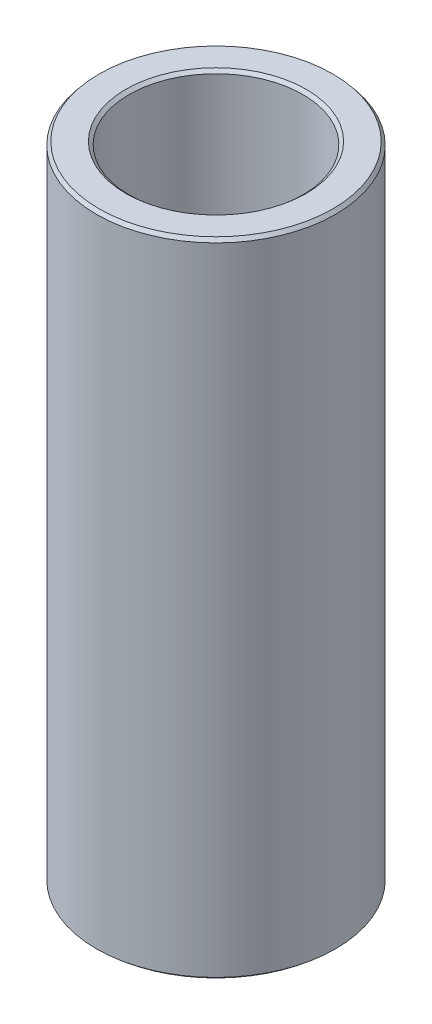
ISO-10303-21;
HEADER;
FILE_DESCRIPTION(('STEP AP214'),'2;1');
FILE_NAME('part.step','',(''),(''),'','','');
FILE_SCHEMA(('AUTOMOTIVE_DESIGN { 1 0 10303 214 1 1 1 1 }'));
ENDSEC;
DATA;
#1=APPLICATION_CONTEXT('core data for automotive mechanical design processes');
#2=APPLICATION_PROTOCOL_DEFINITION('international standard','automotive_design',2000,#1);
#3=PRODUCT_CONTEXT('',#1,'mechanical');
#4=PRODUCT('Part','Part','',(#3));
#5=PRODUCT_RELATED_PRODUCT_CATEGORY('part','',(#4));
#6=PRODUCT_DEFINITION_FORMATION('','',#4);
#7=PRODUCT_DEFINITION_CONTEXT('part definition',#1,'design');
#8=PRODUCT_DEFINITION('design','',#6,#7);
#9=PRODUCT_DEFINITION_SHAPE('','',#8);
#10=(LENGTH_UNIT() NAMED_UNIT(*) SI_UNIT(.MILLI.,.METRE.));
#11=(NAMED_UNIT(*) PLANE_ANGLE_UNIT() SI_UNIT($,.RADIAN.));
#12=(NAMED_UNIT(*) SI_UNIT($,.STERADIAN.) SOLID_ANGLE_UNIT());
#13=UNCERTAINTY_MEASURE_WITH_UNIT(LENGTH_MEASURE(1.E-05),#10,'distance_accuracy_value','');
#14=(GEOMETRIC_REPRESENTATION_CONTEXT(3) GLOBAL_UNCERTAINTY_ASSIGNED_CONTEXT((#13)) GLOBAL_UNIT_ASSIGNED_CONTEXT((#10,
#11,#12)) REPRESENTATION_CONTEXT('',''));
#15=CARTESIAN_POINT('',(0.,0.,0.));
#16=DIRECTION('',(0.,0.,1.));
#17=DIRECTION('',(1.,0.,0.));
#18=AXIS2_PLACEMENT_3D('',#15,#16,#17);
#19=CARTESIAN_POINT('',(0.,187.842386874486,0.));
#20=DIRECTION('',(0.,-1.,0.));
#21=DIRECTION('',(0.,0.,-1.));
#22=AXIS2_PLACEMENT_3D('',#19,#20,#21);
#23=CYLINDRICAL_SURFACE('',#22,35.);
#24=CARTESIAN_POINT('',(0.,0.828744511712359,0.));
#25=DIRECTION('',(0.,1.,0.));
#26=DIRECTION('',(0.,0.,1.));
#27=AXIS2_PLACEMENT_3D('',#24,#25,#26);
#28=CIRCLE('',#27,35.);
#29=CARTESIAN_POINT('',(0.,0.828744511712359,35.));
#30=VERTEX_POINT('',#29);
#31=EDGE_CURVE('E10',#30,#30,#28,.T.);
#32=ORIENTED_EDGE('',*,*,#31,.T.);
#33=EDGE_LOOP('',(#32));
#34=FACE_BOUND('',#33,.T.);
#35=CARTESIAN_POINT('',(0.,186.867769661363,0.));
#36=DIRECTION('',(0.,1.,0.));
#37=DIRECTION('',(0.,0.,1.));
#38=AXIS2_PLACEMENT_3D('',#35,#36,#37);
#39=CIRCLE('',#38,35.);
#40=CARTESIAN_POINT('',(0.,186.867769661363,35.));
#41=VERTEX_POINT('',#40);
#42=EDGE_CURVE('E50',#41,#41,#39,.F.);
#43=ORIENTED_EDGE('',*,*,#42,.T.);
#44=EDGE_LOOP('',(#43));
#45=FACE_BOUND('',#44,.T.);
#46=ADVANCED_FACE('F39',(#34,#45),#23,.T.);
#47=CARTESIAN_POINT('',(0.,187.842386874486,0.));
#48=DIRECTION('',(0.,1.,0.));
#49=DIRECTION('',(0.,0.,1.));
#50=AXIS2_PLACEMENT_3D('',#47,#48,#49);
#51=PLANE('',#50);
#52=CARTESIAN_POINT('',(0.,187.842386874486,0.));
#53=DIRECTION('',(0.,1.,0.));
#54=DIRECTION('',(0.,0.,1.));
#55=AXIS2_PLACEMENT_3D('',#52,#53,#54);
#56=CIRCLE('',#55,26.3927424818006);
#57=CARTESIAN_POINT('',(0.,187.842386874486,26.3927424818006));
#58=VERTEX_POINT('',#57);
#59=EDGE_CURVE('E58',#58,#58,#56,.F.);
#60=ORIENTED_EDGE('',*,*,#59,.T.);
#61=EDGE_LOOP('',(#60));
#62=FACE_BOUND('',#61,.T.);
#63=CARTESIAN_POINT('',(0.,187.842386874486,0.));
#64=DIRECTION('',(0.,1.,0.));
#65=DIRECTION('',(0.,0.,1.));
#66=AXIS2_PLACEMENT_3D('',#63,#64,#65);
#67=CIRCLE('',#66,34.1712554882877);
#68=CARTESIAN_POINT('',(0.,187.842386874486,34.1712554882877));
#69=VERTEX_POINT('',#68);
#70=EDGE_CURVE('E61',#69,#69,#67,.T.);
#71=ORIENTED_EDGE('',*,*,#70,.T.);
#72=EDGE_LOOP('',(#71));
#73=FACE_BOUND('',#72,.T.);
#74=ADVANCED_FACE('F88',(#62,#73),#51,.T.);
#75=CARTESIAN_POINT('',(0.,0.,0.));
#76=DIRECTION('',(0.,1.,0.));
#77=DIRECTION('',(0.,0.,1.));
#78=AXIS2_PLACEMENT_3D('',#75,#76,#77);
#79=PLANE('',#78);
#80=CARTESIAN_POINT('',(0.,0.,0.));
#81=DIRECTION('',(0.,1.,0.));
#82=DIRECTION('',(0.,0.,1.));
#83=AXIS2_PLACEMENT_3D('',#80,#81,#82);
#84=CIRCLE('',#83,26.24686978039);
#85=CARTESIAN_POINT('',(0.,0.,26.24686978039));
#86=VERTEX_POINT('',#85);
#87=EDGE_CURVE('E51',#86,#86,#84,.T.);
#88=ORIENTED_EDGE('',*,*,#87,.T.);
#89=EDGE_LOOP('',(#88));
#90=FACE_BOUND('',#89,.T.);
#91=CARTESIAN_POINT('',(0.,0.,0.));
#92=DIRECTION('',(0.,1.,0.));
#93=DIRECTION('',(0.,0.,1.));
#94=AXIS2_PLACEMENT_3D('',#91,#92,#93);
#95=CIRCLE('',#94,34.0253827868769);
#96=CARTESIAN_POINT('',(0.,0.,34.0253827868769));
#97=VERTEX_POINT('',#96);
#98=EDGE_CURVE('E54',#97,#97,#95,.F.);
#99=ORIENTED_EDGE('',*,*,#98,.T.);
#100=EDGE_LOOP('',(#99));
#101=FACE_BOUND('',#100,.T.);
#102=ADVANCED_FACE('F83',(#90,#101),#79,.F.);
#103=CARTESIAN_POINT('',(0.,187.842386874486,0.));
#104=DIRECTION('',(0.,-1.,0.));
#105=DIRECTION('',(0.,0.,-1.));
#106=AXIS2_PLACEMENT_3D('',#103,#104,#105);
#107=CYLINDRICAL_SURFACE('',#106,25.4181252686777);
#108=CARTESIAN_POINT('',(0.,187.013642362774,0.));
#109=DIRECTION('',(0.,1.,0.));
#110=DIRECTION('',(0.,0.,1.));
#111=AXIS2_PLACEMENT_3D('',#108,#109,#110);
#112=CIRCLE('',#111,25.4181252686777);
#113=CARTESIAN_POINT('',(0.,187.013642362774,25.4181252686777));
#114=VERTEX_POINT('',#113);
#115=EDGE_CURVE('E67',#114,#114,#112,.T.);
#116=ORIENTED_EDGE('',*,*,#115,.T.);
#117=EDGE_LOOP('',(#116));
#118=FACE_BOUND('',#117,.T.);
#119=CARTESIAN_POINT('',(0.,0.974617213123002,0.));
#120=DIRECTION('',(0.,1.,0.));
#121=DIRECTION('',(0.,0.,1.));
#122=AXIS2_PLACEMENT_3D('',#119,#120,#121);
#123=CIRCLE('',#122,25.4181252686777);
#124=CARTESIAN_POINT('',(0.,0.974617213123002,25.4181252686777));
#125=VERTEX_POINT('',#124);
#126=EDGE_CURVE('E69',#125,#125,#123,.F.);
#127=ORIENTED_EDGE('',*,*,#126,.T.);
#128=EDGE_LOOP('',(#127));
#129=FACE_BOUND('',#128,.T.);
#130=ADVANCED_FACE('F71',(#118,#129),#107,.F.);
#131=CARTESIAN_POINT('',(0.,187.013642362774,0.));
#132=DIRECTION('',(0.,1.,0.));
#133=DIRECTION('',(0.,0.,1.));
#134=AXIS2_PLACEMENT_3D('',#131,#132,#133);
#135=CONICAL_SURFACE('',#134,25.4181252686777,0.866111749736073);
#136=ORIENTED_EDGE('',*,*,#59,.F.);
#137=EDGE_LOOP('',(#136));
#138=FACE_BOUND('',#137,.T.);
#139=ORIENTED_EDGE('',*,*,#115,.F.);
#140=EDGE_LOOP('',(#139));
#141=FACE_BOUND('',#140,.T.);
#142=ADVANCED_FACE('F77',(#138,#141),#135,.F.);
#143=CARTESIAN_POINT('',(0.,0.,0.));
#144=DIRECTION('',(0.,-1.,0.));
#145=DIRECTION('',(0.,0.,-1.));
#146=AXIS2_PLACEMENT_3D('',#143,#144,#145);
#147=CONICAL_SURFACE('',#146,26.24686978039,0.704684577058815);
#148=ORIENTED_EDGE('',*,*,#126,.F.);
#149=EDGE_LOOP('',(#148));
#150=FACE_BOUND('',#149,.T.);
#151=ORIENTED_EDGE('',*,*,#87,.F.);
#152=EDGE_LOOP('',(#151));
#153=FACE_BOUND('',#152,.T.);
#154=ADVANCED_FACE('F73',(#150,#153),#147,.F.);
#155=CARTESIAN_POINT('',(0.,0.828744511712359,0.));
#156=DIRECTION('',(0.,1.,0.));
#157=DIRECTION('',(0.,0.,1.));
#158=AXIS2_PLACEMENT_3D('',#155,#156,#157);
#159=CONICAL_SURFACE('',#158,35.,0.866111749736072);
#160=ORIENTED_EDGE('',*,*,#98,.F.);
#161=EDGE_LOOP('',(#160));
#162=FACE_BOUND('',#161,.T.);
#163=ORIENTED_EDGE('',*,*,#31,.F.);
#164=EDGE_LOOP('',(#163));
#165=FACE_BOUND('',#164,.T.);
#166=ADVANCED_FACE('F76',(#162,#165),#159,.T.);
#167=CARTESIAN_POINT('',(0.,187.842386874486,0.));
#168=DIRECTION('',(0.,-1.,0.));
#169=DIRECTION('',(0.,0.,-1.));
#170=AXIS2_PLACEMENT_3D('',#167,#168,#169);
#171=CONICAL_SURFACE('',#170,34.1712554882877,0.704684577058844);
#172=ORIENTED_EDGE('',*,*,#42,.F.);
#173=EDGE_LOOP('',(#172));
#174=FACE_BOUND('',#173,.T.);
#175=ORIENTED_EDGE('',*,*,#70,.F.);
#176=EDGE_LOOP('',(#175));
#177=FACE_BOUND('',#176,.T.);
#178=ADVANCED_FACE('F45',(#174,#177),#171,.T.);
#179=CLOSED_SHELL('',(#46,#74,#102,#130,#142,#154,#166,#178));
#180=MANIFOLD_SOLID_BREP('B2',#179);
#181=ADVANCED_BREP_SHAPE_REPRESENTATION('',(#18,#180),#14);
#182=SHAPE_DEFINITION_REPRESENTATION(#9,#181);
ENDSEC;
END-ISO-10303-21;
